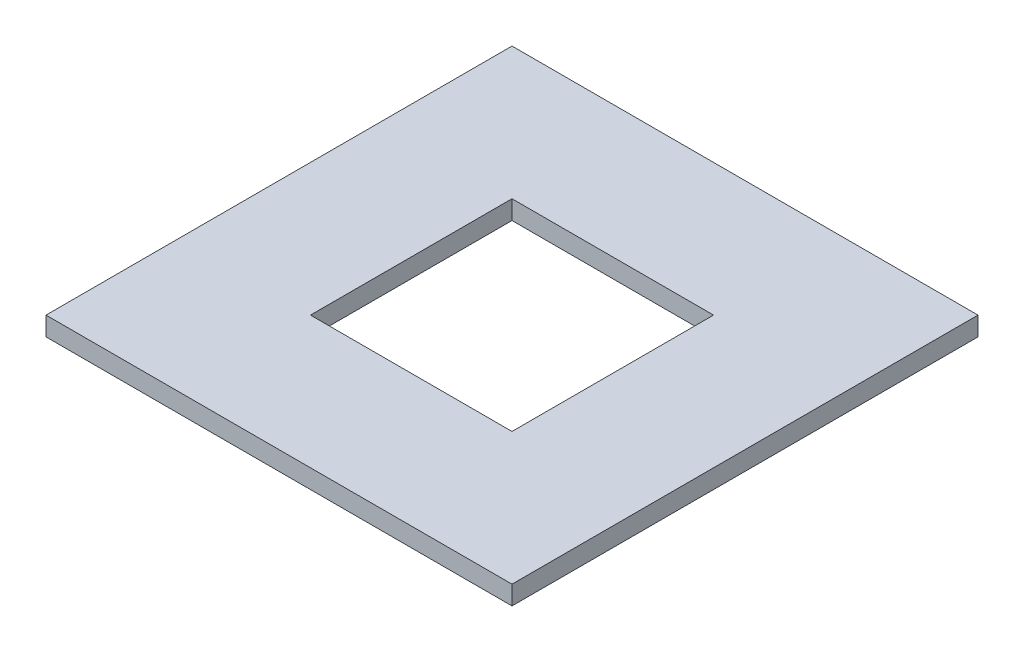
ISO-10303-21;
HEADER;
FILE_DESCRIPTION(('STEP AP214'),'2;1');
FILE_NAME('part.step','',(''),(''),'','','');
FILE_SCHEMA(('AUTOMOTIVE_DESIGN { 1 0 10303 214 1 1 1 1 }'));
ENDSEC;
DATA;
#1=APPLICATION_CONTEXT('core data for automotive mechanical design processes');
#2=APPLICATION_PROTOCOL_DEFINITION('international standard','automotive_design',2000,#1);
#3=PRODUCT_CONTEXT('',#1,'mechanical');
#4=PRODUCT('Part','Part','',(#3));
#5=PRODUCT_RELATED_PRODUCT_CATEGORY('part','',(#4));
#6=PRODUCT_DEFINITION_FORMATION('','',#4);
#7=PRODUCT_DEFINITION_CONTEXT('part definition',#1,'design');
#8=PRODUCT_DEFINITION('design','',#6,#7);
#9=PRODUCT_DEFINITION_SHAPE('','',#8);
#10=(LENGTH_UNIT() NAMED_UNIT(*) SI_UNIT(.MILLI.,.METRE.));
#11=(NAMED_UNIT(*) PLANE_ANGLE_UNIT() SI_UNIT($,.RADIAN.));
#12=(NAMED_UNIT(*) SI_UNIT($,.STERADIAN.) SOLID_ANGLE_UNIT());
#13=UNCERTAINTY_MEASURE_WITH_UNIT(LENGTH_MEASURE(1.E-05),#10,'distance_accuracy_value','');
#14=(GEOMETRIC_REPRESENTATION_CONTEXT(3) GLOBAL_UNCERTAINTY_ASSIGNED_CONTEXT((#13)) GLOBAL_UNIT_ASSIGNED_CONTEXT((#10,
#11,#12)) REPRESENTATION_CONTEXT('',''));
#15=CARTESIAN_POINT('',(0.,0.,0.));
#16=DIRECTION('',(0.,0.,1.));
#17=DIRECTION('',(1.,0.,0.));
#18=AXIS2_PLACEMENT_3D('',#15,#16,#17);
#19=CARTESIAN_POINT('',(0.,3.,0.));
#20=DIRECTION('',(0.,1.,0.));
#21=DIRECTION('',(0.,0.,1.));
#22=AXIS2_PLACEMENT_3D('',#19,#20,#21);
#23=PLANE('',#22);
#24=DIRECTION('',(0.,0.,1.));
#25=VECTOR('',#24,1.);
#26=CARTESIAN_POINT('',(-37.,3.,-37.));
#27=LINE('',#26,#25);
#28=CARTESIAN_POINT('',(-37.,3.,-37.));
#29=VERTEX_POINT('',#28);
#30=CARTESIAN_POINT('',(-37.,3.,37.));
#31=VERTEX_POINT('',#30);
#32=EDGE_CURVE('E136',#29,#31,#27,.T.);
#33=ORIENTED_EDGE('',*,*,#32,.T.);
#34=DIRECTION('',(1.,0.,0.));
#35=VECTOR('',#34,1.);
#36=CARTESIAN_POINT('',(-37.,3.,37.));
#37=LINE('',#36,#35);
#38=CARTESIAN_POINT('',(37.,3.,37.));
#39=VERTEX_POINT('',#38);
#40=EDGE_CURVE('E139',#31,#39,#37,.T.);
#41=ORIENTED_EDGE('',*,*,#40,.T.);
#42=DIRECTION('',(0.,0.,-1.));
#43=VECTOR('',#42,1.);
#44=CARTESIAN_POINT('',(37.,3.,-37.));
#45=LINE('',#44,#43);
#46=CARTESIAN_POINT('',(37.,3.,-37.));
#47=VERTEX_POINT('',#46);
#48=EDGE_CURVE('E142',#39,#47,#45,.T.);
#49=ORIENTED_EDGE('',*,*,#48,.T.);
#50=DIRECTION('',(-1.,0.,0.));
#51=VECTOR('',#50,1.);
#52=CARTESIAN_POINT('',(-37.,3.,-37.));
#53=LINE('',#52,#51);
#54=EDGE_CURVE('E144',#47,#29,#53,.T.);
#55=ORIENTED_EDGE('',*,*,#54,.T.);
#56=EDGE_LOOP('',(#33,#41,#49,#55));
#57=FACE_BOUND('',#56,.T.);
#58=DIRECTION('',(1.,0.,0.));
#59=VECTOR('',#58,1.);
#60=CARTESIAN_POINT('',(-16.,3.,16.));
#61=LINE('',#60,#59);
#62=CARTESIAN_POINT('',(-16.,3.,16.));
#63=VERTEX_POINT('',#62);
#64=CARTESIAN_POINT('',(16.,3.,16.));
#65=VERTEX_POINT('',#64);
#66=EDGE_CURVE('E106',#63,#65,#61,.T.);
#67=ORIENTED_EDGE('',*,*,#66,.F.);
#68=DIRECTION('',(0.,0.,1.));
#69=VECTOR('',#68,1.);
#70=CARTESIAN_POINT('',(-16.,3.,16.));
#71=LINE('',#70,#69);
#72=CARTESIAN_POINT('',(-16.,3.,-16.));
#73=VERTEX_POINT('',#72);
#74=EDGE_CURVE('E98',#73,#63,#71,.T.);
#75=ORIENTED_EDGE('',*,*,#74,.F.);
#76=DIRECTION('',(-1.,0.,0.));
#77=VECTOR('',#76,1.);
#78=CARTESIAN_POINT('',(-16.,3.,-16.));
#79=LINE('',#78,#77);
#80=CARTESIAN_POINT('',(16.,3.,-16.));
#81=VERTEX_POINT('',#80);
#82=EDGE_CURVE('E120',#81,#73,#79,.T.);
#83=ORIENTED_EDGE('',*,*,#82,.F.);
#84=DIRECTION('',(0.,0.,-1.));
#85=VECTOR('',#84,1.);
#86=CARTESIAN_POINT('',(16.,3.,16.));
#87=LINE('',#86,#85);
#88=EDGE_CURVE('E118',#65,#81,#87,.T.);
#89=ORIENTED_EDGE('',*,*,#88,.F.);
#90=EDGE_LOOP('',(#67,#75,#83,#89));
#91=FACE_BOUND('',#90,.T.);
#92=ADVANCED_FACE('F33',(#57,#91),#23,.T.);
#93=CARTESIAN_POINT('',(0.,0.,0.));
#94=DIRECTION('',(0.,1.,0.));
#95=DIRECTION('',(0.,0.,1.));
#96=AXIS2_PLACEMENT_3D('',#93,#94,#95);
#97=PLANE('',#96);
#98=CARTESIAN_POINT('',(-22.,0.,22.));
#99=DIRECTION('',(0.,1.,0.));
#100=DIRECTION('',(0.,0.,1.));
#101=AXIS2_PLACEMENT_3D('',#98,#99,#100);
#102=CIRCLE('',#101,1.8);
#103=CARTESIAN_POINT('',(-22.,0.,23.8));
#104=VERTEX_POINT('',#103);
#105=EDGE_CURVE('E265',#104,#104,#102,.T.);
#106=ORIENTED_EDGE('',*,*,#105,.T.);
#107=EDGE_LOOP('',(#106));
#108=FACE_BOUND('',#107,.T.);
#109=CARTESIAN_POINT('',(22.,0.,22.));
#110=DIRECTION('',(0.,1.,0.));
#111=DIRECTION('',(0.,0.,1.));
#112=AXIS2_PLACEMENT_3D('',#109,#110,#111);
#113=CIRCLE('',#112,1.8);
#114=CARTESIAN_POINT('',(22.,0.,23.8));
#115=VERTEX_POINT('',#114);
#116=EDGE_CURVE('E259',#115,#115,#113,.T.);
#117=ORIENTED_EDGE('',*,*,#116,.T.);
#118=EDGE_LOOP('',(#117));
#119=FACE_BOUND('',#118,.T.);
#120=CARTESIAN_POINT('',(22.,0.,-22.));
#121=DIRECTION('',(0.,1.,0.));
#122=DIRECTION('',(0.,0.,1.));
#123=AXIS2_PLACEMENT_3D('',#120,#121,#122);
#124=CIRCLE('',#123,1.8);
#125=CARTESIAN_POINT('',(22.,0.,-20.2));
#126=VERTEX_POINT('',#125);
#127=EDGE_CURVE('E250',#126,#126,#124,.T.);
#128=ORIENTED_EDGE('',*,*,#127,.T.);
#129=EDGE_LOOP('',(#128));
#130=FACE_BOUND('',#129,.T.);
#131=CARTESIAN_POINT('',(-22.,0.,-22.));
#132=DIRECTION('',(0.,1.,0.));
#133=DIRECTION('',(0.,0.,1.));
#134=AXIS2_PLACEMENT_3D('',#131,#132,#133);
#135=CIRCLE('',#134,1.8);
#136=CARTESIAN_POINT('',(-22.,0.,-20.2));
#137=VERTEX_POINT('',#136);
#138=EDGE_CURVE('E249',#137,#137,#135,.T.);
#139=ORIENTED_EDGE('',*,*,#138,.T.);
#140=EDGE_LOOP('',(#139));
#141=FACE_BOUND('',#140,.T.);
#142=DIRECTION('',(0.,0.,1.));
#143=VECTOR('',#142,1.);
#144=CARTESIAN_POINT('',(-37.,0.,-37.));
#145=LINE('',#144,#143);
#146=CARTESIAN_POINT('',(-37.,0.,-37.));
#147=VERTEX_POINT('',#146);
#148=CARTESIAN_POINT('',(-37.,0.,37.));
#149=VERTEX_POINT('',#148);
#150=EDGE_CURVE('E114',#147,#149,#145,.T.);
#151=ORIENTED_EDGE('',*,*,#150,.F.);
#152=DIRECTION('',(-1.,0.,0.));
#153=VECTOR('',#152,1.);
#154=CARTESIAN_POINT('',(-37.,0.,-37.));
#155=LINE('',#154,#153);
#156=CARTESIAN_POINT('',(37.,0.,-37.));
#157=VERTEX_POINT('',#156);
#158=EDGE_CURVE('E140',#157,#147,#155,.T.);
#159=ORIENTED_EDGE('',*,*,#158,.F.);
#160=DIRECTION('',(0.,0.,-1.));
#161=VECTOR('',#160,1.);
#162=CARTESIAN_POINT('',(37.,0.,-37.));
#163=LINE('',#162,#161);
#164=CARTESIAN_POINT('',(37.,0.,37.));
#165=VERTEX_POINT('',#164);
#166=EDGE_CURVE('E151',#165,#157,#163,.T.);
#167=ORIENTED_EDGE('',*,*,#166,.F.);
#168=DIRECTION('',(1.,0.,0.));
#169=VECTOR('',#168,1.);
#170=CARTESIAN_POINT('',(-37.,0.,37.));
#171=LINE('',#170,#169);
#172=EDGE_CURVE('E149',#149,#165,#171,.T.);
#173=ORIENTED_EDGE('',*,*,#172,.F.);
#174=EDGE_LOOP('',(#151,#159,#167,#173));
#175=FACE_BOUND('',#174,.T.);
#176=DIRECTION('',(0.,0.,1.));
#177=VECTOR('',#176,1.);
#178=CARTESIAN_POINT('',(-16.,0.,16.));
#179=LINE('',#178,#177);
#180=CARTESIAN_POINT('',(-16.,0.,-16.));
#181=VERTEX_POINT('',#180);
#182=CARTESIAN_POINT('',(-16.,0.,16.));
#183=VERTEX_POINT('',#182);
#184=EDGE_CURVE('E56',#181,#183,#179,.T.);
#185=ORIENTED_EDGE('',*,*,#184,.T.);
#186=DIRECTION('',(1.,0.,0.));
#187=VECTOR('',#186,1.);
#188=CARTESIAN_POINT('',(-16.,0.,16.));
#189=LINE('',#188,#187);
#190=CARTESIAN_POINT('',(16.,0.,16.));
#191=VERTEX_POINT('',#190);
#192=EDGE_CURVE('E113',#183,#191,#189,.T.);
#193=ORIENTED_EDGE('',*,*,#192,.T.);
#194=DIRECTION('',(0.,0.,-1.));
#195=VECTOR('',#194,1.);
#196=CARTESIAN_POINT('',(16.,0.,16.));
#197=LINE('',#196,#195);
#198=CARTESIAN_POINT('',(16.,0.,-16.));
#199=VERTEX_POINT('',#198);
#200=EDGE_CURVE('E128',#191,#199,#197,.T.);
#201=ORIENTED_EDGE('',*,*,#200,.T.);
#202=DIRECTION('',(-1.,0.,0.));
#203=VECTOR('',#202,1.);
#204=CARTESIAN_POINT('',(-16.,0.,-16.));
#205=LINE('',#204,#203);
#206=EDGE_CURVE('E107',#199,#181,#205,.T.);
#207=ORIENTED_EDGE('',*,*,#206,.T.);
#208=EDGE_LOOP('',(#185,#193,#201,#207));
#209=FACE_BOUND('',#208,.T.);
#210=ADVANCED_FACE('F169',(#108,#119,#130,#141,#175,#209),#97,.F.);
#211=CARTESIAN_POINT('',(-37.,3.,-37.));
#212=DIRECTION('',(1.,0.,0.));
#213=DIRECTION('',(0.,0.,-1.));
#214=AXIS2_PLACEMENT_3D('',#211,#212,#213);
#215=PLANE('',#214);
#216=ORIENTED_EDGE('',*,*,#150,.T.);
#217=DIRECTION('',(0.,-1.,0.));
#218=VECTOR('',#217,1.);
#219=CARTESIAN_POINT('',(-37.,3.,37.));
#220=LINE('',#219,#218);
#221=EDGE_CURVE('E11',#31,#149,#220,.T.);
#222=ORIENTED_EDGE('',*,*,#221,.F.);
#223=ORIENTED_EDGE('',*,*,#32,.F.);
#224=DIRECTION('',(0.,-1.,0.));
#225=VECTOR('',#224,1.);
#226=CARTESIAN_POINT('',(-37.,3.,-37.));
#227=LINE('',#226,#225);
#228=EDGE_CURVE('E146',#29,#147,#227,.T.);
#229=ORIENTED_EDGE('',*,*,#228,.T.);
#230=EDGE_LOOP('',(#216,#222,#223,#229));
#231=FACE_BOUND('',#230,.T.);
#232=ADVANCED_FACE('F35',(#231),#215,.F.);
#233=CARTESIAN_POINT('',(-37.,3.,37.));
#234=DIRECTION('',(0.,0.,-1.));
#235=DIRECTION('',(-1.,0.,0.));
#236=AXIS2_PLACEMENT_3D('',#233,#234,#235);
#237=PLANE('',#236);
#238=ORIENTED_EDGE('',*,*,#172,.T.);
#239=DIRECTION('',(0.,-1.,0.));
#240=VECTOR('',#239,1.);
#241=CARTESIAN_POINT('',(37.,3.,37.));
#242=LINE('',#241,#240);
#243=EDGE_CURVE('E41',#39,#165,#242,.T.);
#244=ORIENTED_EDGE('',*,*,#243,.F.);
#245=ORIENTED_EDGE('',*,*,#40,.F.);
#246=ORIENTED_EDGE('',*,*,#221,.T.);
#247=EDGE_LOOP('',(#238,#244,#245,#246));
#248=FACE_BOUND('',#247,.T.);
#249=ADVANCED_FACE('F179',(#248),#237,.F.);
#250=CARTESIAN_POINT('',(37.,3.,-37.));
#251=DIRECTION('',(-1.,0.,0.));
#252=DIRECTION('',(0.,0.,1.));
#253=AXIS2_PLACEMENT_3D('',#250,#251,#252);
#254=PLANE('',#253);
#255=ORIENTED_EDGE('',*,*,#166,.T.);
#256=DIRECTION('',(0.,-1.,0.));
#257=VECTOR('',#256,1.);
#258=CARTESIAN_POINT('',(37.,3.,-37.));
#259=LINE('',#258,#257);
#260=EDGE_CURVE('E156',#47,#157,#259,.T.);
#261=ORIENTED_EDGE('',*,*,#260,.F.);
#262=ORIENTED_EDGE('',*,*,#48,.F.);
#263=ORIENTED_EDGE('',*,*,#243,.T.);
#264=EDGE_LOOP('',(#255,#261,#262,#263));
#265=FACE_BOUND('',#264,.T.);
#266=ADVANCED_FACE('F163',(#265),#254,.F.);
#267=CARTESIAN_POINT('',(-37.,3.,-37.));
#268=DIRECTION('',(0.,0.,1.));
#269=DIRECTION('',(1.,0.,0.));
#270=AXIS2_PLACEMENT_3D('',#267,#268,#269);
#271=PLANE('',#270);
#272=ORIENTED_EDGE('',*,*,#158,.T.);
#273=ORIENTED_EDGE('',*,*,#228,.F.);
#274=ORIENTED_EDGE('',*,*,#54,.F.);
#275=ORIENTED_EDGE('',*,*,#260,.T.);
#276=EDGE_LOOP('',(#272,#273,#274,#275));
#277=FACE_BOUND('',#276,.T.);
#278=ADVANCED_FACE('F173',(#277),#271,.F.);
#279=CARTESIAN_POINT('',(-16.,3.,16.));
#280=DIRECTION('',(1.,0.,0.));
#281=DIRECTION('',(0.,0.,-1.));
#282=AXIS2_PLACEMENT_3D('',#279,#280,#281);
#283=PLANE('',#282);
#284=ORIENTED_EDGE('',*,*,#184,.F.);
#285=DIRECTION('',(0.,-1.,0.));
#286=VECTOR('',#285,1.);
#287=CARTESIAN_POINT('',(-16.,3.,-16.));
#288=LINE('',#287,#286);
#289=EDGE_CURVE('E102',#73,#181,#288,.T.);
#290=ORIENTED_EDGE('',*,*,#289,.F.);
#291=ORIENTED_EDGE('',*,*,#74,.T.);
#292=DIRECTION('',(0.,-1.,0.));
#293=VECTOR('',#292,1.);
#294=CARTESIAN_POINT('',(-16.,3.,16.));
#295=LINE('',#294,#293);
#296=EDGE_CURVE('E101',#63,#183,#295,.T.);
#297=ORIENTED_EDGE('',*,*,#296,.T.);
#298=EDGE_LOOP('',(#284,#290,#291,#297));
#299=FACE_BOUND('',#298,.T.);
#300=ADVANCED_FACE('F100',(#299),#283,.T.);
#301=CARTESIAN_POINT('',(-16.,3.,16.));
#302=DIRECTION('',(0.,0.,-1.));
#303=DIRECTION('',(-1.,0.,0.));
#304=AXIS2_PLACEMENT_3D('',#301,#302,#303);
#305=PLANE('',#304);
#306=ORIENTED_EDGE('',*,*,#192,.F.);
#307=ORIENTED_EDGE('',*,*,#296,.F.);
#308=ORIENTED_EDGE('',*,*,#66,.T.);
#309=DIRECTION('',(0.,-1.,0.));
#310=VECTOR('',#309,1.);
#311=CARTESIAN_POINT('',(16.,3.,16.));
#312=LINE('',#311,#310);
#313=EDGE_CURVE('E115',#65,#191,#312,.T.);
#314=ORIENTED_EDGE('',*,*,#313,.T.);
#315=EDGE_LOOP('',(#306,#307,#308,#314));
#316=FACE_BOUND('',#315,.T.);
#317=ADVANCED_FACE('F110',(#316),#305,.T.);
#318=CARTESIAN_POINT('',(16.,3.,16.));
#319=DIRECTION('',(-1.,0.,0.));
#320=DIRECTION('',(0.,0.,1.));
#321=AXIS2_PLACEMENT_3D('',#318,#319,#320);
#322=PLANE('',#321);
#323=ORIENTED_EDGE('',*,*,#200,.F.);
#324=ORIENTED_EDGE('',*,*,#313,.F.);
#325=ORIENTED_EDGE('',*,*,#88,.T.);
#326=DIRECTION('',(0.,-1.,0.));
#327=VECTOR('',#326,1.);
#328=CARTESIAN_POINT('',(16.,3.,-16.));
#329=LINE('',#328,#327);
#330=EDGE_CURVE('E48',#81,#199,#329,.T.);
#331=ORIENTED_EDGE('',*,*,#330,.T.);
#332=EDGE_LOOP('',(#323,#324,#325,#331));
#333=FACE_BOUND('',#332,.T.);
#334=ADVANCED_FACE('F203',(#333),#322,.T.);
#335=CARTESIAN_POINT('',(-16.,3.,-16.));
#336=DIRECTION('',(0.,0.,1.));
#337=DIRECTION('',(1.,0.,0.));
#338=AXIS2_PLACEMENT_3D('',#335,#336,#337);
#339=PLANE('',#338);
#340=ORIENTED_EDGE('',*,*,#206,.F.);
#341=ORIENTED_EDGE('',*,*,#330,.F.);
#342=ORIENTED_EDGE('',*,*,#82,.T.);
#343=ORIENTED_EDGE('',*,*,#289,.T.);
#344=EDGE_LOOP('',(#340,#341,#342,#343));
#345=FACE_BOUND('',#344,.T.);
#346=ADVANCED_FACE('F207',(#345),#339,.T.);
#347=CARTESIAN_POINT('',(-22.,1.5,-22.));
#348=DIRECTION('',(0.,-1.,0.));
#349=DIRECTION('',(0.,0.,-1.));
#350=AXIS2_PLACEMENT_3D('',#347,#348,#349);
#351=CYLINDRICAL_SURFACE('',#350,1.8);
#352=CARTESIAN_POINT('',(-22.,1.5,-22.));
#353=DIRECTION('',(0.,1.,0.));
#354=DIRECTION('',(0.,0.,1.));
#355=AXIS2_PLACEMENT_3D('',#352,#353,#354);
#356=CIRCLE('',#355,1.8);
#357=CARTESIAN_POINT('',(-22.,1.5,-20.2));
#358=VERTEX_POINT('',#357);
#359=EDGE_CURVE('E126',#358,#358,#356,.T.);
#360=ORIENTED_EDGE('',*,*,#359,.T.);
#361=EDGE_LOOP('',(#360));
#362=FACE_BOUND('',#361,.T.);
#363=ORIENTED_EDGE('',*,*,#138,.F.);
#364=EDGE_LOOP('',(#363));
#365=FACE_BOUND('',#364,.T.);
#366=ADVANCED_FACE('F213',(#362,#365),#351,.F.);
#367=CARTESIAN_POINT('',(-22.,1.5,-22.));
#368=DIRECTION('',(0.,1.,0.));
#369=DIRECTION('',(0.,0.,1.));
#370=AXIS2_PLACEMENT_3D('',#367,#368,#369);
#371=PLANE('',#370);
#372=ORIENTED_EDGE('',*,*,#359,.F.);
#373=EDGE_LOOP('',(#372));
#374=FACE_BOUND('',#373,.T.);
#375=ADVANCED_FACE('F216',(#374),#371,.F.);
#376=CARTESIAN_POINT('',(22.,1.5,-22.));
#377=DIRECTION('',(0.,-1.,0.));
#378=DIRECTION('',(0.,0.,-1.));
#379=AXIS2_PLACEMENT_3D('',#376,#377,#378);
#380=CYLINDRICAL_SURFACE('',#379,1.8);
#381=CARTESIAN_POINT('',(22.,1.5,-22.));
#382=DIRECTION('',(0.,1.,0.));
#383=DIRECTION('',(0.,0.,1.));
#384=AXIS2_PLACEMENT_3D('',#381,#382,#383);
#385=CIRCLE('',#384,1.8);
#386=CARTESIAN_POINT('',(22.,1.5,-20.2));
#387=VERTEX_POINT('',#386);
#388=EDGE_CURVE('E248',#387,#387,#385,.T.);
#389=ORIENTED_EDGE('',*,*,#388,.T.);
#390=EDGE_LOOP('',(#389));
#391=FACE_BOUND('',#390,.T.);
#392=ORIENTED_EDGE('',*,*,#127,.F.);
#393=EDGE_LOOP('',(#392));
#394=FACE_BOUND('',#393,.T.);
#395=ADVANCED_FACE('F220',(#391,#394),#380,.F.);
#396=CARTESIAN_POINT('',(22.,1.5,-22.));
#397=DIRECTION('',(0.,1.,0.));
#398=DIRECTION('',(0.,0.,1.));
#399=AXIS2_PLACEMENT_3D('',#396,#397,#398);
#400=PLANE('',#399);
#401=ORIENTED_EDGE('',*,*,#388,.F.);
#402=EDGE_LOOP('',(#401));
#403=FACE_BOUND('',#402,.T.);
#404=ADVANCED_FACE('F234',(#403),#400,.F.);
#405=CARTESIAN_POINT('',(22.,1.5,22.));
#406=DIRECTION('',(0.,-1.,0.));
#407=DIRECTION('',(0.,0.,-1.));
#408=AXIS2_PLACEMENT_3D('',#405,#406,#407);
#409=CYLINDRICAL_SURFACE('',#408,1.8);
#410=CARTESIAN_POINT('',(22.,1.5,22.));
#411=DIRECTION('',(0.,1.,0.));
#412=DIRECTION('',(0.,0.,1.));
#413=AXIS2_PLACEMENT_3D('',#410,#411,#412);
#414=CIRCLE('',#413,1.8);
#415=CARTESIAN_POINT('',(22.,1.5,23.8));
#416=VERTEX_POINT('',#415);
#417=EDGE_CURVE('E254',#416,#416,#414,.T.);
#418=ORIENTED_EDGE('',*,*,#417,.T.);
#419=EDGE_LOOP('',(#418));
#420=FACE_BOUND('',#419,.T.);
#421=ORIENTED_EDGE('',*,*,#116,.F.);
#422=EDGE_LOOP('',(#421));
#423=FACE_BOUND('',#422,.T.);
#424=ADVANCED_FACE('F231',(#420,#423),#409,.F.);
#425=CARTESIAN_POINT('',(22.,1.5,22.));
#426=DIRECTION('',(0.,1.,0.));
#427=DIRECTION('',(0.,0.,1.));
#428=AXIS2_PLACEMENT_3D('',#425,#426,#427);
#429=PLANE('',#428);
#430=ORIENTED_EDGE('',*,*,#417,.F.);
#431=EDGE_LOOP('',(#430));
#432=FACE_BOUND('',#431,.T.);
#433=ADVANCED_FACE('F226',(#432),#429,.F.);
#434=CARTESIAN_POINT('',(-22.,1.5,22.));
#435=DIRECTION('',(0.,-1.,0.));
#436=DIRECTION('',(0.,0.,-1.));
#437=AXIS2_PLACEMENT_3D('',#434,#435,#436);
#438=CYLINDRICAL_SURFACE('',#437,1.8);
#439=CARTESIAN_POINT('',(-22.,1.5,22.));
#440=DIRECTION('',(0.,1.,0.));
#441=DIRECTION('',(0.,0.,1.));
#442=AXIS2_PLACEMENT_3D('',#439,#440,#441);
#443=CIRCLE('',#442,1.8);
#444=CARTESIAN_POINT('',(-22.,1.5,23.8));
#445=VERTEX_POINT('',#444);
#446=EDGE_CURVE('E262',#445,#445,#443,.T.);
#447=ORIENTED_EDGE('',*,*,#446,.T.);
#448=EDGE_LOOP('',(#447));
#449=FACE_BOUND('',#448,.T.);
#450=ORIENTED_EDGE('',*,*,#105,.F.);
#451=EDGE_LOOP('',(#450));
#452=FACE_BOUND('',#451,.T.);
#453=ADVANCED_FACE('F222',(#449,#452),#438,.F.);
#454=CARTESIAN_POINT('',(-22.,1.5,22.));
#455=DIRECTION('',(0.,1.,0.));
#456=DIRECTION('',(0.,0.,1.));
#457=AXIS2_PLACEMENT_3D('',#454,#455,#456);
#458=PLANE('',#457);
#459=ORIENTED_EDGE('',*,*,#446,.F.);
#460=EDGE_LOOP('',(#459));
#461=FACE_BOUND('',#460,.T.);
#462=ADVANCED_FACE('F225',(#461),#458,.F.);
#463=CLOSED_SHELL('',(#92,#210,#232,#249,#266,#278,#300,#317,#334,#346,#366,#375,#395,#404,#424,
#433,#453,#462));
#464=MANIFOLD_SOLID_BREP('B2',#463);
#465=ADVANCED_BREP_SHAPE_REPRESENTATION('',(#18,#464),#14);
#466=SHAPE_DEFINITION_REPRESENTATION(#9,#465);
ENDSEC;
END-ISO-10303-21;
